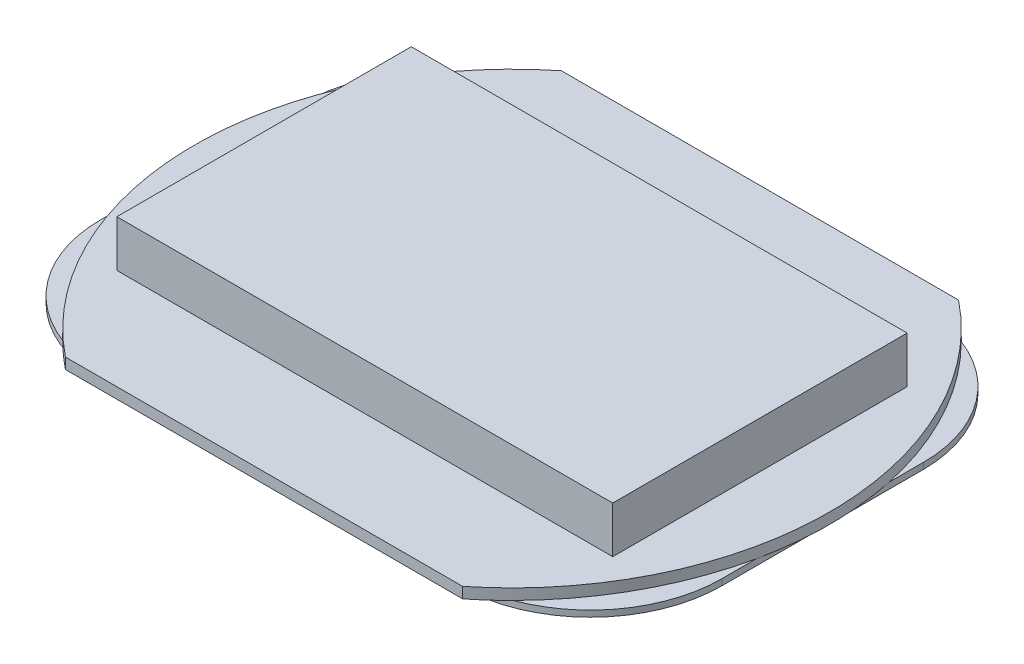
ISO-10303-21;
HEADER;
FILE_DESCRIPTION(('STEP AP214'),'2;1');
FILE_NAME('part.step','',(''),(''),'','','');
FILE_SCHEMA(('AUTOMOTIVE_DESIGN { 1 0 10303 214 1 1 1 1 }'));
ENDSEC;
DATA;
#1=APPLICATION_CONTEXT('core data for automotive mechanical design processes');
#2=APPLICATION_PROTOCOL_DEFINITION('international standard','automotive_design',2000,#1);
#3=PRODUCT_CONTEXT('',#1,'mechanical');
#4=PRODUCT('Part','Part','',(#3));
#5=PRODUCT_RELATED_PRODUCT_CATEGORY('part','',(#4));
#6=PRODUCT_DEFINITION_FORMATION('','',#4);
#7=PRODUCT_DEFINITION_CONTEXT('part definition',#1,'design');
#8=PRODUCT_DEFINITION('design','',#6,#7);
#9=PRODUCT_DEFINITION_SHAPE('','',#8);
#10=(LENGTH_UNIT() NAMED_UNIT(*) SI_UNIT(.MILLI.,.METRE.));
#11=(NAMED_UNIT(*) PLANE_ANGLE_UNIT() SI_UNIT($,.RADIAN.));
#12=(NAMED_UNIT(*) SI_UNIT($,.STERADIAN.) SOLID_ANGLE_UNIT());
#13=UNCERTAINTY_MEASURE_WITH_UNIT(LENGTH_MEASURE(1.E-05),#10,'distance_accuracy_value','');
#14=(GEOMETRIC_REPRESENTATION_CONTEXT(3) GLOBAL_UNCERTAINTY_ASSIGNED_CONTEXT((#13)) GLOBAL_UNIT_ASSIGNED_CONTEXT((#10,
#11,#12)) REPRESENTATION_CONTEXT('',''));
#15=CARTESIAN_POINT('',(0.,0.,0.));
#16=DIRECTION('',(0.,0.,1.));
#17=DIRECTION('',(1.,0.,0.));
#18=AXIS2_PLACEMENT_3D('',#15,#16,#17);
#19=CARTESIAN_POINT('',(0.,0.7,0.));
#20=DIRECTION('',(0.,-1.,0.));
#21=DIRECTION('',(0.,0.,-1.));
#22=AXIS2_PLACEMENT_3D('',#19,#20,#21);
#23=PLANE('',#22);
#24=CARTESIAN_POINT('',(0.,0.7,0.));
#25=DIRECTION('',(0.,1.,0.));
#26=DIRECTION('',(0.,0.,-1.));
#27=AXIS2_PLACEMENT_3D('',#24,#25,#26);
#28=CIRCLE('',#27,20.5);
#29=CARTESIAN_POINT('',(-12.8160056179763,0.7,-16.));
#30=VERTEX_POINT('',#29);
#31=CARTESIAN_POINT('',(-12.8160056179763,0.7,16.));
#32=VERTEX_POINT('',#31);
#33=EDGE_CURVE('E329',#30,#32,#28,.T.);
#34=ORIENTED_EDGE('',*,*,#33,.T.);
#35=DIRECTION('',(1.,0.,0.));
#36=VECTOR('',#35,1.);
#37=CARTESIAN_POINT('',(-12.8160056179763,0.7,16.));
#38=LINE('',#37,#36);
#39=CARTESIAN_POINT('',(12.8160056179763,0.7,16.));
#40=VERTEX_POINT('',#39);
#41=EDGE_CURVE('E332',#32,#40,#38,.T.);
#42=ORIENTED_EDGE('',*,*,#41,.T.);
#43=CARTESIAN_POINT('',(0.,0.7,0.));
#44=DIRECTION('',(0.,1.,0.));
#45=DIRECTION('',(0.,0.,1.));
#46=AXIS2_PLACEMENT_3D('',#43,#44,#45);
#47=CIRCLE('',#46,20.5);
#48=CARTESIAN_POINT('',(12.8160056179763,0.7,-16.));
#49=VERTEX_POINT('',#48);
#50=EDGE_CURVE('E335',#40,#49,#47,.T.);
#51=ORIENTED_EDGE('',*,*,#50,.T.);
#52=DIRECTION('',(-1.,0.,0.));
#53=VECTOR('',#52,1.);
#54=CARTESIAN_POINT('',(-12.8160056179763,0.7,-16.));
#55=LINE('',#54,#53);
#56=EDGE_CURVE('E337',#49,#30,#55,.T.);
#57=ORIENTED_EDGE('',*,*,#56,.T.);
#58=EDGE_LOOP('',(#34,#42,#51,#57));
#59=FACE_BOUND('',#58,.T.);
#60=DIRECTION('',(0.,0.,1.));
#61=VECTOR('',#60,1.);
#62=CARTESIAN_POINT('',(-16.,0.7,-9.5));
#63=LINE('',#62,#61);
#64=CARTESIAN_POINT('',(-16.,0.7,-9.5));
#65=VERTEX_POINT('',#64);
#66=CARTESIAN_POINT('',(-16.,0.7,9.5));
#67=VERTEX_POINT('',#66);
#68=EDGE_CURVE('E223',#65,#67,#63,.T.);
#69=ORIENTED_EDGE('',*,*,#68,.F.);
#70=DIRECTION('',(-1.,0.,0.));
#71=VECTOR('',#70,1.);
#72=CARTESIAN_POINT('',(-16.,0.7,-9.5));
#73=LINE('',#72,#71);
#74=CARTESIAN_POINT('',(16.,0.7,-9.5));
#75=VERTEX_POINT('',#74);
#76=EDGE_CURVE('E220',#75,#65,#73,.T.);
#77=ORIENTED_EDGE('',*,*,#76,.F.);
#78=DIRECTION('',(0.,0.,-1.));
#79=VECTOR('',#78,1.);
#80=CARTESIAN_POINT('',(16.,0.7,-9.5));
#81=LINE('',#80,#79);
#82=CARTESIAN_POINT('',(16.,0.7,9.5));
#83=VERTEX_POINT('',#82);
#84=EDGE_CURVE('E62',#83,#75,#81,.T.);
#85=ORIENTED_EDGE('',*,*,#84,.F.);
#86=DIRECTION('',(1.,0.,0.));
#87=VECTOR('',#86,1.);
#88=CARTESIAN_POINT('',(-16.,0.7,9.5));
#89=LINE('',#88,#87);
#90=EDGE_CURVE('E57',#67,#83,#89,.T.);
#91=ORIENTED_EDGE('',*,*,#90,.F.);
#92=EDGE_LOOP('',(#69,#77,#85,#91));
#93=FACE_BOUND('',#92,.T.);
#94=ADVANCED_FACE('F39',(#59,#93),#23,.F.);
#95=CARTESIAN_POINT('',(0.,0.,0.));
#96=DIRECTION('',(0.,-1.,0.));
#97=DIRECTION('',(0.,0.,-1.));
#98=AXIS2_PLACEMENT_3D('',#95,#96,#97);
#99=PLANE('',#98);
#100=CARTESIAN_POINT('',(-11.55,0.,6.49999999999998));
#101=DIRECTION('',(0.,-1.,0.));
#102=DIRECTION('',(0.,0.,-1.));
#103=AXIS2_PLACEMENT_3D('',#100,#101,#102);
#104=CIRCLE('',#103,8.50000000000002);
#105=CARTESIAN_POINT('',(-11.55,0.,15.));
#106=VERTEX_POINT('',#105);
#107=CARTESIAN_POINT('',(-14.5312597172372,0.,14.46003081014));
#108=VERTEX_POINT('',#107);
#109=EDGE_CURVE('E279',#106,#108,#104,.T.);
#110=ORIENTED_EDGE('',*,*,#109,.F.);
#111=DIRECTION('',(-1.,0.,0.));
#112=VECTOR('',#111,1.);
#113=CARTESIAN_POINT('',(-11.55,0.,15.));
#114=LINE('',#113,#112);
#115=CARTESIAN_POINT('',(11.55,0.,15.));
#116=VERTEX_POINT('',#115);
#117=EDGE_CURVE('E264',#116,#106,#114,.T.);
#118=ORIENTED_EDGE('',*,*,#117,.F.);
#119=CARTESIAN_POINT('',(11.55,0.,6.5));
#120=DIRECTION('',(0.,-1.,0.));
#121=DIRECTION('',(0.,0.,1.));
#122=AXIS2_PLACEMENT_3D('',#119,#120,#121);
#123=CIRCLE('',#122,8.5);
#124=CARTESIAN_POINT('',(14.5312597172372,0.,14.46003081014));
#125=VERTEX_POINT('',#124);
#126=EDGE_CURVE('E11',#125,#116,#123,.T.);
#127=ORIENTED_EDGE('',*,*,#126,.F.);
#128=CARTESIAN_POINT('',(0.,0.,0.));
#129=DIRECTION('',(0.,1.,0.));
#130=DIRECTION('',(0.,0.,1.));
#131=AXIS2_PLACEMENT_3D('',#128,#129,#130);
#132=CIRCLE('',#131,20.5);
#133=CARTESIAN_POINT('',(12.8160056179763,0.,16.));
#134=VERTEX_POINT('',#133);
#135=EDGE_CURVE('E347',#134,#125,#132,.T.);
#136=ORIENTED_EDGE('',*,*,#135,.F.);
#137=DIRECTION('',(1.,0.,0.));
#138=VECTOR('',#137,1.);
#139=CARTESIAN_POINT('',(-12.8160056179763,0.,16.));
#140=LINE('',#139,#138);
#141=CARTESIAN_POINT('',(-12.8160056179763,0.,16.));
#142=VERTEX_POINT('',#141);
#143=EDGE_CURVE('E343',#142,#134,#140,.T.);
#144=ORIENTED_EDGE('',*,*,#143,.F.);
#145=CARTESIAN_POINT('',(0.,0.,0.));
#146=DIRECTION('',(0.,1.,0.));
#147=DIRECTION('',(0.,0.,-1.));
#148=AXIS2_PLACEMENT_3D('',#145,#146,#147);
#149=CIRCLE('',#148,20.5);
#150=EDGE_CURVE('E328',#108,#142,#149,.T.);
#151=ORIENTED_EDGE('',*,*,#150,.F.);
#152=EDGE_LOOP('',(#110,#118,#127,#136,#144,#151));
#153=FACE_BOUND('',#152,.T.);
#154=ADVANCED_FACE('F390',(#153),#99,.T.);
#155=DIRECTION('',(0.,0.,1.));
#156=VECTOR('',#155,1.);
#157=CARTESIAN_POINT('',(20.05,0.,6.5));
#158=LINE('',#157,#156);
#159=CARTESIAN_POINT('',(20.05,0.,-4.2717092597694));
#160=VERTEX_POINT('',#159);
#161=CARTESIAN_POINT('',(20.05,0.,4.27170925976939));
#162=VERTEX_POINT('',#161);
#163=EDGE_CURVE('E48',#160,#162,#158,.T.);
#164=ORIENTED_EDGE('',*,*,#163,.F.);
#165=EDGE_CURVE('E507',#162,#160,#132,.T.);
#166=ORIENTED_EDGE('',*,*,#165,.F.);
#167=EDGE_LOOP('',(#164,#166));
#168=FACE_BOUND('',#167,.T.);
#169=ADVANCED_FACE('F435',(#168),#99,.T.);
#170=CARTESIAN_POINT('',(11.55,0.,-6.50000000000001));
#171=DIRECTION('',(0.,-1.,0.));
#172=DIRECTION('',(0.,0.,-1.));
#173=AXIS2_PLACEMENT_3D('',#170,#171,#172);
#174=CIRCLE('',#173,8.49999999999999);
#175=CARTESIAN_POINT('',(11.55,0.,-15.));
#176=VERTEX_POINT('',#175);
#177=CARTESIAN_POINT('',(14.5312597172372,0.,-14.46003081014));
#178=VERTEX_POINT('',#177);
#179=EDGE_CURVE('E295',#176,#178,#174,.T.);
#180=ORIENTED_EDGE('',*,*,#179,.F.);
#181=DIRECTION('',(1.,0.,0.));
#182=VECTOR('',#181,1.);
#183=CARTESIAN_POINT('',(-11.55,0.,-15.));
#184=LINE('',#183,#182);
#185=CARTESIAN_POINT('',(-11.55,0.,-15.));
#186=VERTEX_POINT('',#185);
#187=EDGE_CURVE('E290',#186,#176,#184,.T.);
#188=ORIENTED_EDGE('',*,*,#187,.F.);
#189=CARTESIAN_POINT('',(-11.55,0.,-6.49999999999999));
#190=DIRECTION('',(0.,-1.,0.));
#191=DIRECTION('',(0.,0.,-1.));
#192=AXIS2_PLACEMENT_3D('',#189,#190,#191);
#193=CIRCLE('',#192,8.50000000000001);
#194=CARTESIAN_POINT('',(-14.5312597172372,0.,-14.46003081014));
#195=VERTEX_POINT('',#194);
#196=EDGE_CURVE('E291',#195,#186,#193,.T.);
#197=ORIENTED_EDGE('',*,*,#196,.F.);
#198=CARTESIAN_POINT('',(-12.8160056179763,0.,-16.));
#199=VERTEX_POINT('',#198);
#200=EDGE_CURVE('E340',#199,#195,#149,.T.);
#201=ORIENTED_EDGE('',*,*,#200,.F.);
#202=DIRECTION('',(-1.,0.,0.));
#203=VECTOR('',#202,1.);
#204=CARTESIAN_POINT('',(-12.8160056179763,0.,-16.));
#205=LINE('',#204,#203);
#206=CARTESIAN_POINT('',(12.8160056179763,0.,-16.));
#207=VERTEX_POINT('',#206);
#208=EDGE_CURVE('E333',#207,#199,#205,.T.);
#209=ORIENTED_EDGE('',*,*,#208,.F.);
#210=EDGE_CURVE('E346',#178,#207,#132,.T.);
#211=ORIENTED_EDGE('',*,*,#210,.F.);
#212=EDGE_LOOP('',(#180,#188,#197,#201,#209,#211));
#213=FACE_BOUND('',#212,.T.);
#214=ADVANCED_FACE('F401',(#213),#99,.T.);
#215=CARTESIAN_POINT('',(0.,0.7,0.));
#216=DIRECTION('',(0.,-1.,0.));
#217=DIRECTION('',(0.,0.,-1.));
#218=AXIS2_PLACEMENT_3D('',#215,#216,#217);
#219=CYLINDRICAL_SURFACE('',#218,20.5);
#220=ORIENTED_EDGE('',*,*,#200,.T.);
#221=CARTESIAN_POINT('',(-20.05,0.,-4.2717092597695));
#222=VERTEX_POINT('',#221);
#223=EDGE_CURVE('E344',#195,#222,#149,.T.);
#224=ORIENTED_EDGE('',*,*,#223,.T.);
#225=CARTESIAN_POINT('',(-20.05,0.,4.2717092597695));
#226=VERTEX_POINT('',#225);
#227=EDGE_CURVE('E382',#222,#226,#149,.T.);
#228=ORIENTED_EDGE('',*,*,#227,.T.);
#229=EDGE_CURVE('E383',#226,#108,#149,.T.);
#230=ORIENTED_EDGE('',*,*,#229,.T.);
#231=ORIENTED_EDGE('',*,*,#150,.T.);
#232=DIRECTION('',(0.,-1.,0.));
#233=VECTOR('',#232,1.);
#234=CARTESIAN_POINT('',(-12.8160056179763,0.7,16.));
#235=LINE('',#234,#233);
#236=EDGE_CURVE('E43',#32,#142,#235,.T.);
#237=ORIENTED_EDGE('',*,*,#236,.F.);
#238=ORIENTED_EDGE('',*,*,#33,.F.);
#239=DIRECTION('',(0.,-1.,0.));
#240=VECTOR('',#239,1.);
#241=CARTESIAN_POINT('',(-12.8160056179763,0.7,-16.));
#242=LINE('',#241,#240);
#243=EDGE_CURVE('E339',#30,#199,#242,.T.);
#244=ORIENTED_EDGE('',*,*,#243,.T.);
#245=EDGE_LOOP('',(#220,#224,#228,#230,#231,#237,#238,#244));
#246=FACE_BOUND('',#245,.T.);
#247=ADVANCED_FACE('F41',(#246),#219,.T.);
#248=CARTESIAN_POINT('',(-12.8160056179763,0.7,16.));
#249=DIRECTION('',(0.,0.,-1.));
#250=DIRECTION('',(-1.,0.,0.));
#251=AXIS2_PLACEMENT_3D('',#248,#249,#250);
#252=PLANE('',#251);
#253=ORIENTED_EDGE('',*,*,#143,.T.);
#254=DIRECTION('',(0.,-1.,0.));
#255=VECTOR('',#254,1.);
#256=CARTESIAN_POINT('',(12.8160056179763,0.7,16.));
#257=LINE('',#256,#255);
#258=EDGE_CURVE('E356',#40,#134,#257,.T.);
#259=ORIENTED_EDGE('',*,*,#258,.F.);
#260=ORIENTED_EDGE('',*,*,#41,.F.);
#261=ORIENTED_EDGE('',*,*,#236,.T.);
#262=EDGE_LOOP('',(#253,#259,#260,#261));
#263=FACE_BOUND('',#262,.T.);
#264=ADVANCED_FACE('F391',(#263),#252,.F.);
#265=CARTESIAN_POINT('',(0.,0.7,0.));
#266=DIRECTION('',(0.,-1.,0.));
#267=DIRECTION('',(0.,0.,-1.));
#268=AXIS2_PLACEMENT_3D('',#265,#266,#267);
#269=CYLINDRICAL_SURFACE('',#268,20.5);
#270=ORIENTED_EDGE('',*,*,#135,.T.);
#271=EDGE_CURVE('E350',#125,#162,#132,.T.);
#272=ORIENTED_EDGE('',*,*,#271,.T.);
#273=ORIENTED_EDGE('',*,*,#165,.T.);
#274=EDGE_CURVE('E505',#160,#178,#132,.T.);
#275=ORIENTED_EDGE('',*,*,#274,.T.);
#276=ORIENTED_EDGE('',*,*,#210,.T.);
#277=DIRECTION('',(0.,-1.,0.));
#278=VECTOR('',#277,1.);
#279=CARTESIAN_POINT('',(12.8160056179763,0.7,-16.));
#280=LINE('',#279,#278);
#281=EDGE_CURVE('E354',#49,#207,#280,.T.);
#282=ORIENTED_EDGE('',*,*,#281,.F.);
#283=ORIENTED_EDGE('',*,*,#50,.F.);
#284=ORIENTED_EDGE('',*,*,#258,.T.);
#285=EDGE_LOOP('',(#270,#272,#273,#275,#276,#282,#283,#284));
#286=FACE_BOUND('',#285,.T.);
#287=ADVANCED_FACE('F393',(#286),#269,.T.);
#288=CARTESIAN_POINT('',(-12.8160056179763,0.7,-16.));
#289=DIRECTION('',(0.,0.,1.));
#290=DIRECTION('',(1.,0.,0.));
#291=AXIS2_PLACEMENT_3D('',#288,#289,#290);
#292=PLANE('',#291);
#293=ORIENTED_EDGE('',*,*,#208,.T.);
#294=ORIENTED_EDGE('',*,*,#243,.F.);
#295=ORIENTED_EDGE('',*,*,#56,.F.);
#296=ORIENTED_EDGE('',*,*,#281,.T.);
#297=EDGE_LOOP('',(#293,#294,#295,#296));
#298=FACE_BOUND('',#297,.T.);
#299=ADVANCED_FACE('F441',(#298),#292,.F.);
#300=DIRECTION('',(0.,0.,-1.));
#301=VECTOR('',#300,1.);
#302=CARTESIAN_POINT('',(-20.05,0.,6.5));
#303=LINE('',#302,#301);
#304=EDGE_CURVE('E287',#226,#222,#303,.T.);
#305=ORIENTED_EDGE('',*,*,#304,.F.);
#306=ORIENTED_EDGE('',*,*,#227,.F.);
#307=EDGE_LOOP('',(#305,#306));
#308=FACE_BOUND('',#307,.T.);
#309=ADVANCED_FACE('F427',(#308),#99,.T.);
#310=CARTESIAN_POINT('',(-11.55,0.,6.49999999999998));
#311=DIRECTION('',(0.,-1.,0.));
#312=DIRECTION('',(0.,0.,-1.));
#313=AXIS2_PLACEMENT_3D('',#310,#311,#312);
#314=PLANE('',#313);
#315=ORIENTED_EDGE('',*,*,#223,.F.);
#316=CARTESIAN_POINT('',(-20.05,0.,-6.5));
#317=VERTEX_POINT('',#316);
#318=EDGE_CURVE('E286',#317,#195,#193,.T.);
#319=ORIENTED_EDGE('',*,*,#318,.F.);
#320=EDGE_CURVE('E282',#222,#317,#303,.T.);
#321=ORIENTED_EDGE('',*,*,#320,.F.);
#322=EDGE_LOOP('',(#315,#319,#321));
#323=FACE_BOUND('',#322,.T.);
#324=ADVANCED_FACE('F378',(#323),#314,.F.);
#325=ORIENTED_EDGE('',*,*,#229,.F.);
#326=CARTESIAN_POINT('',(-20.05,0.,6.5));
#327=VERTEX_POINT('',#326);
#328=EDGE_CURVE('E283',#327,#226,#303,.T.);
#329=ORIENTED_EDGE('',*,*,#328,.F.);
#330=EDGE_CURVE('E259',#108,#327,#104,.T.);
#331=ORIENTED_EDGE('',*,*,#330,.F.);
#332=EDGE_LOOP('',(#325,#329,#331));
#333=FACE_BOUND('',#332,.T.);
#334=ADVANCED_FACE('F417',(#333),#314,.F.);
#335=ORIENTED_EDGE('',*,*,#271,.F.);
#336=CARTESIAN_POINT('',(20.05,0.,6.5));
#337=VERTEX_POINT('',#336);
#338=EDGE_CURVE('E50',#337,#125,#123,.T.);
#339=ORIENTED_EDGE('',*,*,#338,.F.);
#340=EDGE_CURVE('E298',#162,#337,#158,.T.);
#341=ORIENTED_EDGE('',*,*,#340,.F.);
#342=EDGE_LOOP('',(#335,#339,#341));
#343=FACE_BOUND('',#342,.T.);
#344=ADVANCED_FACE('F419',(#343),#314,.F.);
#345=CARTESIAN_POINT('',(-11.55,-0.4,6.49999999999998));
#346=DIRECTION('',(0.,-1.,0.));
#347=DIRECTION('',(0.,0.,-1.));
#348=AXIS2_PLACEMENT_3D('',#345,#346,#347);
#349=PLANE('',#348);
#350=CARTESIAN_POINT('',(-11.55,-0.4,6.49999999999998));
#351=DIRECTION('',(0.,-1.,0.));
#352=DIRECTION('',(0.,0.,-1.));
#353=AXIS2_PLACEMENT_3D('',#350,#351,#352);
#354=CIRCLE('',#353,8.50000000000002);
#355=CARTESIAN_POINT('',(-11.55,-0.4,15.));
#356=VERTEX_POINT('',#355);
#357=CARTESIAN_POINT('',(-20.05,-0.4,6.5));
#358=VERTEX_POINT('',#357);
#359=EDGE_CURVE('E260',#356,#358,#354,.T.);
#360=ORIENTED_EDGE('',*,*,#359,.T.);
#361=DIRECTION('',(0.,0.,-1.));
#362=VECTOR('',#361,1.);
#363=CARTESIAN_POINT('',(-20.05,-0.4,6.5));
#364=LINE('',#363,#362);
#365=CARTESIAN_POINT('',(-20.05,-0.4,-6.5));
#366=VERTEX_POINT('',#365);
#367=EDGE_CURVE('E263',#358,#366,#364,.T.);
#368=ORIENTED_EDGE('',*,*,#367,.T.);
#369=CARTESIAN_POINT('',(-11.55,-0.4,-6.49999999999999));
#370=DIRECTION('',(0.,-1.,0.));
#371=DIRECTION('',(0.,0.,-1.));
#372=AXIS2_PLACEMENT_3D('',#369,#370,#371);
#373=CIRCLE('',#372,8.50000000000001);
#374=CARTESIAN_POINT('',(-11.55,-0.4,-15.));
#375=VERTEX_POINT('',#374);
#376=EDGE_CURVE('E266',#366,#375,#373,.T.);
#377=ORIENTED_EDGE('',*,*,#376,.T.);
#378=DIRECTION('',(1.,0.,0.));
#379=VECTOR('',#378,1.);
#380=CARTESIAN_POINT('',(-11.55,-0.4,-15.));
#381=LINE('',#380,#379);
#382=CARTESIAN_POINT('',(11.55,-0.4,-15.));
#383=VERTEX_POINT('',#382);
#384=EDGE_CURVE('E268',#375,#383,#381,.T.);
#385=ORIENTED_EDGE('',*,*,#384,.T.);
#386=CARTESIAN_POINT('',(11.55,-0.4,-6.50000000000001));
#387=DIRECTION('',(0.,-1.,0.));
#388=DIRECTION('',(0.,0.,-1.));
#389=AXIS2_PLACEMENT_3D('',#386,#387,#388);
#390=CIRCLE('',#389,8.49999999999999);
#391=CARTESIAN_POINT('',(20.05,-0.4,-6.5));
#392=VERTEX_POINT('',#391);
#393=EDGE_CURVE('E270',#383,#392,#390,.T.);
#394=ORIENTED_EDGE('',*,*,#393,.T.);
#395=DIRECTION('',(0.,0.,1.));
#396=VECTOR('',#395,1.);
#397=CARTESIAN_POINT('',(20.05,-0.4,6.5));
#398=LINE('',#397,#396);
#399=CARTESIAN_POINT('',(20.05,-0.4,6.5));
#400=VERTEX_POINT('',#399);
#401=EDGE_CURVE('E272',#392,#400,#398,.T.);
#402=ORIENTED_EDGE('',*,*,#401,.T.);
#403=CARTESIAN_POINT('',(11.55,-0.4,6.5));
#404=DIRECTION('',(0.,-1.,0.));
#405=DIRECTION('',(0.,0.,1.));
#406=AXIS2_PLACEMENT_3D('',#403,#404,#405);
#407=CIRCLE('',#406,8.5);
#408=CARTESIAN_POINT('',(11.55,-0.4,15.));
#409=VERTEX_POINT('',#408);
#410=EDGE_CURVE('E274',#400,#409,#407,.T.);
#411=ORIENTED_EDGE('',*,*,#410,.T.);
#412=DIRECTION('',(-1.,0.,0.));
#413=VECTOR('',#412,1.);
#414=CARTESIAN_POINT('',(-11.55,-0.4,15.));
#415=LINE('',#414,#413);
#416=EDGE_CURVE('E276',#409,#356,#415,.T.);
#417=ORIENTED_EDGE('',*,*,#416,.T.);
#418=EDGE_LOOP('',(#360,#368,#377,#385,#394,#402,#411,#417));
#419=FACE_BOUND('',#418,.T.);
#420=DIRECTION('',(1.,0.,0.));
#421=VECTOR('',#420,1.);
#422=CARTESIAN_POINT('',(-11.,-0.4,-5.5));
#423=LINE('',#422,#421);
#424=CARTESIAN_POINT('',(-11.,-0.4,-5.5));
#425=VERTEX_POINT('',#424);
#426=CARTESIAN_POINT('',(11.,-0.4,-5.5));
#427=VERTEX_POINT('',#426);
#428=EDGE_CURVE('E235',#425,#427,#423,.T.);
#429=ORIENTED_EDGE('',*,*,#428,.F.);
#430=DIRECTION('',(0.,0.,-1.));
#431=VECTOR('',#430,1.);
#432=CARTESIAN_POINT('',(-11.,-0.4,5.5));
#433=LINE('',#432,#431);
#434=CARTESIAN_POINT('',(-11.,-0.4,5.5));
#435=VERTEX_POINT('',#434);
#436=EDGE_CURVE('E233',#435,#425,#433,.T.);
#437=ORIENTED_EDGE('',*,*,#436,.F.);
#438=DIRECTION('',(-1.,0.,0.));
#439=VECTOR('',#438,1.);
#440=CARTESIAN_POINT('',(-11.,-0.4,5.5));
#441=LINE('',#440,#439);
#442=CARTESIAN_POINT('',(11.,-0.4,5.5));
#443=VERTEX_POINT('',#442);
#444=EDGE_CURVE('E241',#443,#435,#441,.T.);
#445=ORIENTED_EDGE('',*,*,#444,.F.);
#446=DIRECTION('',(0.,0.,1.));
#447=VECTOR('',#446,1.);
#448=CARTESIAN_POINT('',(11.,-0.4,5.5));
#449=LINE('',#448,#447);
#450=EDGE_CURVE('E238',#427,#443,#449,.T.);
#451=ORIENTED_EDGE('',*,*,#450,.F.);
#452=EDGE_LOOP('',(#429,#437,#445,#451));
#453=FACE_BOUND('',#452,.T.);
#454=ADVANCED_FACE('F408',(#419,#453),#349,.T.);
#455=ORIENTED_EDGE('',*,*,#274,.F.);
#456=CARTESIAN_POINT('',(20.05,0.,-6.5));
#457=VERTEX_POINT('',#456);
#458=EDGE_CURVE('E299',#457,#160,#158,.T.);
#459=ORIENTED_EDGE('',*,*,#458,.F.);
#460=EDGE_CURVE('E294',#178,#457,#174,.T.);
#461=ORIENTED_EDGE('',*,*,#460,.F.);
#462=EDGE_LOOP('',(#455,#459,#461));
#463=FACE_BOUND('',#462,.T.);
#464=ADVANCED_FACE('F426',(#463),#314,.F.);
#465=CARTESIAN_POINT('',(-11.55,-0.4,6.49999999999998));
#466=DIRECTION('',(0.,1.,0.));
#467=DIRECTION('',(0.,0.,1.));
#468=AXIS2_PLACEMENT_3D('',#465,#466,#467);
#469=CYLINDRICAL_SURFACE('',#468,8.50000000000002);
#470=ORIENTED_EDGE('',*,*,#109,.T.);
#471=ORIENTED_EDGE('',*,*,#330,.T.);
#472=DIRECTION('',(0.,1.,0.));
#473=VECTOR('',#472,1.);
#474=CARTESIAN_POINT('',(-20.05,-0.4,6.5));
#475=LINE('',#474,#473);
#476=EDGE_CURVE('E325',#358,#327,#475,.T.);
#477=ORIENTED_EDGE('',*,*,#476,.F.);
#478=ORIENTED_EDGE('',*,*,#359,.F.);
#479=DIRECTION('',(0.,1.,0.));
#480=VECTOR('',#479,1.);
#481=CARTESIAN_POINT('',(-11.55,-0.4,15.));
#482=LINE('',#481,#480);
#483=EDGE_CURVE('E278',#356,#106,#482,.T.);
#484=ORIENTED_EDGE('',*,*,#483,.T.);
#485=EDGE_LOOP('',(#470,#471,#477,#478,#484));
#486=FACE_BOUND('',#485,.T.);
#487=ADVANCED_FACE('F415',(#486),#469,.T.);
#488=CARTESIAN_POINT('',(-20.05,-0.4,6.5));
#489=DIRECTION('',(1.,0.,0.));
#490=DIRECTION('',(0.,0.,-1.));
#491=AXIS2_PLACEMENT_3D('',#488,#489,#490);
#492=PLANE('',#491);
#493=ORIENTED_EDGE('',*,*,#328,.T.);
#494=ORIENTED_EDGE('',*,*,#304,.T.);
#495=ORIENTED_EDGE('',*,*,#320,.T.);
#496=DIRECTION('',(0.,1.,0.));
#497=VECTOR('',#496,1.);
#498=CARTESIAN_POINT('',(-20.05,-0.4,-6.5));
#499=LINE('',#498,#497);
#500=EDGE_CURVE('E322',#366,#317,#499,.T.);
#501=ORIENTED_EDGE('',*,*,#500,.F.);
#502=ORIENTED_EDGE('',*,*,#367,.F.);
#503=ORIENTED_EDGE('',*,*,#476,.T.);
#504=EDGE_LOOP('',(#493,#494,#495,#501,#502,#503));
#505=FACE_BOUND('',#504,.T.);
#506=ADVANCED_FACE('F370',(#505),#492,.F.);
#507=CARTESIAN_POINT('',(-11.55,-0.4,-6.49999999999999));
#508=DIRECTION('',(0.,1.,0.));
#509=DIRECTION('',(0.,0.,1.));
#510=AXIS2_PLACEMENT_3D('',#507,#508,#509);
#511=CYLINDRICAL_SURFACE('',#510,8.50000000000001);
#512=ORIENTED_EDGE('',*,*,#318,.T.);
#513=ORIENTED_EDGE('',*,*,#196,.T.);
#514=DIRECTION('',(0.,1.,0.));
#515=VECTOR('',#514,1.);
#516=CARTESIAN_POINT('',(-11.55,-0.4,-15.));
#517=LINE('',#516,#515);
#518=EDGE_CURVE('E319',#375,#186,#517,.T.);
#519=ORIENTED_EDGE('',*,*,#518,.F.);
#520=ORIENTED_EDGE('',*,*,#376,.F.);
#521=ORIENTED_EDGE('',*,*,#500,.T.);
#522=EDGE_LOOP('',(#512,#513,#519,#520,#521));
#523=FACE_BOUND('',#522,.T.);
#524=ADVANCED_FACE('F376',(#523),#511,.T.);
#525=CARTESIAN_POINT('',(-11.55,-0.4,-15.));
#526=DIRECTION('',(0.,0.,1.));
#527=DIRECTION('',(1.,0.,0.));
#528=AXIS2_PLACEMENT_3D('',#525,#526,#527);
#529=PLANE('',#528);
#530=ORIENTED_EDGE('',*,*,#187,.T.);
#531=DIRECTION('',(0.,1.,0.));
#532=VECTOR('',#531,1.);
#533=CARTESIAN_POINT('',(11.55,-0.4,-15.));
#534=LINE('',#533,#532);
#535=EDGE_CURVE('E316',#383,#176,#534,.T.);
#536=ORIENTED_EDGE('',*,*,#535,.F.);
#537=ORIENTED_EDGE('',*,*,#384,.F.);
#538=ORIENTED_EDGE('',*,*,#518,.T.);
#539=EDGE_LOOP('',(#530,#536,#537,#538));
#540=FACE_BOUND('',#539,.T.);
#541=ADVANCED_FACE('F404',(#540),#529,.F.);
#542=CARTESIAN_POINT('',(11.55,-0.4,-6.50000000000001));
#543=DIRECTION('',(0.,1.,0.));
#544=DIRECTION('',(0.,0.,1.));
#545=AXIS2_PLACEMENT_3D('',#542,#543,#544);
#546=CYLINDRICAL_SURFACE('',#545,8.49999999999999);
#547=ORIENTED_EDGE('',*,*,#179,.T.);
#548=ORIENTED_EDGE('',*,*,#460,.T.);
#549=DIRECTION('',(0.,1.,0.));
#550=VECTOR('',#549,1.);
#551=CARTESIAN_POINT('',(20.05,-0.4,-6.5));
#552=LINE('',#551,#550);
#553=EDGE_CURVE('E313',#392,#457,#552,.T.);
#554=ORIENTED_EDGE('',*,*,#553,.F.);
#555=ORIENTED_EDGE('',*,*,#393,.F.);
#556=ORIENTED_EDGE('',*,*,#535,.T.);
#557=EDGE_LOOP('',(#547,#548,#554,#555,#556));
#558=FACE_BOUND('',#557,.T.);
#559=ADVANCED_FACE('F514',(#558),#546,.T.);
#560=CARTESIAN_POINT('',(20.05,-0.4,6.5));
#561=DIRECTION('',(-1.,0.,0.));
#562=DIRECTION('',(0.,0.,1.));
#563=AXIS2_PLACEMENT_3D('',#560,#561,#562);
#564=PLANE('',#563);
#565=ORIENTED_EDGE('',*,*,#458,.T.);
#566=ORIENTED_EDGE('',*,*,#163,.T.);
#567=ORIENTED_EDGE('',*,*,#340,.T.);
#568=DIRECTION('',(0.,1.,0.));
#569=VECTOR('',#568,1.);
#570=CARTESIAN_POINT('',(20.05,-0.4,6.5));
#571=LINE('',#570,#569);
#572=EDGE_CURVE('E310',#400,#337,#571,.T.);
#573=ORIENTED_EDGE('',*,*,#572,.F.);
#574=ORIENTED_EDGE('',*,*,#401,.F.);
#575=ORIENTED_EDGE('',*,*,#553,.T.);
#576=EDGE_LOOP('',(#565,#566,#567,#573,#574,#575));
#577=FACE_BOUND('',#576,.T.);
#578=ADVANCED_FACE('F510',(#577),#564,.F.);
#579=CARTESIAN_POINT('',(11.55,-0.4,6.5));
#580=DIRECTION('',(0.,1.,0.));
#581=DIRECTION('',(0.,0.,1.));
#582=AXIS2_PLACEMENT_3D('',#579,#580,#581);
#583=CYLINDRICAL_SURFACE('',#582,8.5);
#584=ORIENTED_EDGE('',*,*,#338,.T.);
#585=ORIENTED_EDGE('',*,*,#126,.T.);
#586=DIRECTION('',(0.,1.,0.));
#587=VECTOR('',#586,1.);
#588=CARTESIAN_POINT('',(11.55,-0.4,15.));
#589=LINE('',#588,#587);
#590=EDGE_CURVE('E307',#409,#116,#589,.T.);
#591=ORIENTED_EDGE('',*,*,#590,.F.);
#592=ORIENTED_EDGE('',*,*,#410,.F.);
#593=ORIENTED_EDGE('',*,*,#572,.T.);
#594=EDGE_LOOP('',(#584,#585,#591,#592,#593));
#595=FACE_BOUND('',#594,.T.);
#596=ADVANCED_FACE('F521',(#595),#583,.T.);
#597=CARTESIAN_POINT('',(-11.55,-0.4,15.));
#598=DIRECTION('',(0.,0.,-1.));
#599=DIRECTION('',(-1.,0.,0.));
#600=AXIS2_PLACEMENT_3D('',#597,#598,#599);
#601=PLANE('',#600);
#602=ORIENTED_EDGE('',*,*,#117,.T.);
#603=ORIENTED_EDGE('',*,*,#483,.F.);
#604=ORIENTED_EDGE('',*,*,#416,.F.);
#605=ORIENTED_EDGE('',*,*,#590,.T.);
#606=EDGE_LOOP('',(#602,#603,#604,#605));
#607=FACE_BOUND('',#606,.T.);
#608=ADVANCED_FACE('F492',(#607),#601,.F.);
#609=CARTESIAN_POINT('',(-11.,-0.4,5.5));
#610=DIRECTION('',(1.,0.,0.));
#611=DIRECTION('',(0.,0.,-1.));
#612=AXIS2_PLACEMENT_3D('',#609,#610,#611);
#613=PLANE('',#612);
#614=DIRECTION('',(0.,0.,-1.));
#615=VECTOR('',#614,1.);
#616=CARTESIAN_POINT('',(-11.,0.,5.5));
#617=LINE('',#616,#615);
#618=CARTESIAN_POINT('',(-11.,0.,5.5));
#619=VERTEX_POINT('',#618);
#620=CARTESIAN_POINT('',(-11.,0.,-5.5));
#621=VERTEX_POINT('',#620);
#622=EDGE_CURVE('E224',#619,#621,#617,.T.);
#623=ORIENTED_EDGE('',*,*,#622,.F.);
#624=DIRECTION('',(0.,1.,0.));
#625=VECTOR('',#624,1.);
#626=CARTESIAN_POINT('',(-11.,-0.4,5.5));
#627=LINE('',#626,#625);
#628=EDGE_CURVE('E242',#435,#619,#627,.T.);
#629=ORIENTED_EDGE('',*,*,#628,.F.);
#630=ORIENTED_EDGE('',*,*,#436,.T.);
#631=DIRECTION('',(0.,1.,0.));
#632=VECTOR('',#631,1.);
#633=CARTESIAN_POINT('',(-11.,-0.4,-5.5));
#634=LINE('',#633,#632);
#635=EDGE_CURVE('E256',#425,#621,#634,.T.);
#636=ORIENTED_EDGE('',*,*,#635,.T.);
#637=EDGE_LOOP('',(#623,#629,#630,#636));
#638=FACE_BOUND('',#637,.T.);
#639=ADVANCED_FACE('F476',(#638),#613,.T.);
#640=CARTESIAN_POINT('',(-11.,-0.4,-5.5));
#641=DIRECTION('',(0.,0.,1.));
#642=DIRECTION('',(1.,0.,0.));
#643=AXIS2_PLACEMENT_3D('',#640,#641,#642);
#644=PLANE('',#643);
#645=DIRECTION('',(1.,0.,0.));
#646=VECTOR('',#645,1.);
#647=CARTESIAN_POINT('',(-11.,0.,-5.5));
#648=LINE('',#647,#646);
#649=CARTESIAN_POINT('',(11.,0.,-5.5));
#650=VERTEX_POINT('',#649);
#651=EDGE_CURVE('E227',#621,#650,#648,.T.);
#652=ORIENTED_EDGE('',*,*,#651,.F.);
#653=ORIENTED_EDGE('',*,*,#635,.F.);
#654=ORIENTED_EDGE('',*,*,#428,.T.);
#655=DIRECTION('',(0.,1.,0.));
#656=VECTOR('',#655,1.);
#657=CARTESIAN_POINT('',(11.,-0.4,-5.5));
#658=LINE('',#657,#656);
#659=EDGE_CURVE('E254',#427,#650,#658,.T.);
#660=ORIENTED_EDGE('',*,*,#659,.T.);
#661=EDGE_LOOP('',(#652,#653,#654,#660));
#662=FACE_BOUND('',#661,.T.);
#663=ADVANCED_FACE('F480',(#662),#644,.T.);
#664=CARTESIAN_POINT('',(11.,-0.4,5.5));
#665=DIRECTION('',(-1.,0.,0.));
#666=DIRECTION('',(0.,0.,1.));
#667=AXIS2_PLACEMENT_3D('',#664,#665,#666);
#668=PLANE('',#667);
#669=DIRECTION('',(0.,0.,1.));
#670=VECTOR('',#669,1.);
#671=CARTESIAN_POINT('',(11.,0.,5.5));
#672=LINE('',#671,#670);
#673=CARTESIAN_POINT('',(11.,0.,5.5));
#674=VERTEX_POINT('',#673);
#675=EDGE_CURVE('E246',#650,#674,#672,.T.);
#676=ORIENTED_EDGE('',*,*,#675,.F.);
#677=ORIENTED_EDGE('',*,*,#659,.F.);
#678=ORIENTED_EDGE('',*,*,#450,.T.);
#679=DIRECTION('',(0.,1.,0.));
#680=VECTOR('',#679,1.);
#681=CARTESIAN_POINT('',(11.,-0.4,5.5));
#682=LINE('',#681,#680);
#683=EDGE_CURVE('E252',#443,#674,#682,.T.);
#684=ORIENTED_EDGE('',*,*,#683,.T.);
#685=EDGE_LOOP('',(#676,#677,#678,#684));
#686=FACE_BOUND('',#685,.T.);
#687=ADVANCED_FACE('F466',(#686),#668,.T.);
#688=CARTESIAN_POINT('',(-11.,-0.4,5.5));
#689=DIRECTION('',(0.,0.,-1.));
#690=DIRECTION('',(-1.,0.,0.));
#691=AXIS2_PLACEMENT_3D('',#688,#689,#690);
#692=PLANE('',#691);
#693=DIRECTION('',(-1.,0.,0.));
#694=VECTOR('',#693,1.);
#695=CARTESIAN_POINT('',(-11.,0.,5.5));
#696=LINE('',#695,#694);
#697=EDGE_CURVE('E236',#674,#619,#696,.T.);
#698=ORIENTED_EDGE('',*,*,#697,.F.);
#699=ORIENTED_EDGE('',*,*,#683,.F.);
#700=ORIENTED_EDGE('',*,*,#444,.T.);
#701=ORIENTED_EDGE('',*,*,#628,.T.);
#702=EDGE_LOOP('',(#698,#699,#700,#701));
#703=FACE_BOUND('',#702,.T.);
#704=ADVANCED_FACE('F459',(#703),#692,.T.);
#705=ORIENTED_EDGE('',*,*,#697,.T.);
#706=ORIENTED_EDGE('',*,*,#622,.T.);
#707=ORIENTED_EDGE('',*,*,#651,.T.);
#708=ORIENTED_EDGE('',*,*,#675,.T.);
#709=EDGE_LOOP('',(#705,#706,#707,#708));
#710=FACE_BOUND('',#709,.T.);
#711=ADVANCED_FACE('F443',(#710),#99,.T.);
#712=CARTESIAN_POINT('',(-16.,3.7,-9.5));
#713=DIRECTION('',(1.,0.,0.));
#714=DIRECTION('',(0.,0.,-1.));
#715=AXIS2_PLACEMENT_3D('',#712,#713,#714);
#716=PLANE('',#715);
#717=ORIENTED_EDGE('',*,*,#68,.T.);
#718=DIRECTION('',(0.,-1.,0.));
#719=VECTOR('',#718,1.);
#720=CARTESIAN_POINT('',(-16.,3.7,9.5));
#721=LINE('',#720,#719);
#722=CARTESIAN_POINT('',(-16.,3.7,9.5));
#723=VERTEX_POINT('',#722);
#724=EDGE_CURVE('E204',#723,#67,#721,.T.);
#725=ORIENTED_EDGE('',*,*,#724,.F.);
#726=DIRECTION('',(0.,0.,1.));
#727=VECTOR('',#726,1.);
#728=CARTESIAN_POINT('',(-16.,3.7,-9.5));
#729=LINE('',#728,#727);
#730=CARTESIAN_POINT('',(-16.,3.7,-9.5));
#731=VERTEX_POINT('',#730);
#732=EDGE_CURVE('E211',#731,#723,#729,.T.);
#733=ORIENTED_EDGE('',*,*,#732,.F.);
#734=DIRECTION('',(0.,-1.,0.));
#735=VECTOR('',#734,1.);
#736=CARTESIAN_POINT('',(-16.,3.7,-9.5));
#737=LINE('',#736,#735);
#738=EDGE_CURVE('E646',#731,#65,#737,.T.);
#739=ORIENTED_EDGE('',*,*,#738,.T.);
#740=EDGE_LOOP('',(#717,#725,#733,#739));
#741=FACE_BOUND('',#740,.T.);
#742=ADVANCED_FACE('F222',(#741),#716,.F.);
#743=CARTESIAN_POINT('',(-16.,3.7,9.5));
#744=DIRECTION('',(0.,0.,-1.));
#745=DIRECTION('',(-1.,0.,0.));
#746=AXIS2_PLACEMENT_3D('',#743,#744,#745);
#747=PLANE('',#746);
#748=ORIENTED_EDGE('',*,*,#90,.T.);
#749=DIRECTION('',(0.,-1.,0.));
#750=VECTOR('',#749,1.);
#751=CARTESIAN_POINT('',(16.,3.7,9.5));
#752=LINE('',#751,#750);
#753=CARTESIAN_POINT('',(16.,3.7,9.5));
#754=VERTEX_POINT('',#753);
#755=EDGE_CURVE('E207',#754,#83,#752,.T.);
#756=ORIENTED_EDGE('',*,*,#755,.F.);
#757=DIRECTION('',(1.,0.,0.));
#758=VECTOR('',#757,1.);
#759=CARTESIAN_POINT('',(-16.,3.7,9.5));
#760=LINE('',#759,#758);
#761=EDGE_CURVE('E200',#723,#754,#760,.T.);
#762=ORIENTED_EDGE('',*,*,#761,.F.);
#763=ORIENTED_EDGE('',*,*,#724,.T.);
#764=EDGE_LOOP('',(#748,#756,#762,#763));
#765=FACE_BOUND('',#764,.T.);
#766=ADVANCED_FACE('F202',(#765),#747,.F.);
#767=CARTESIAN_POINT('',(16.,3.7,-9.5));
#768=DIRECTION('',(-1.,0.,0.));
#769=DIRECTION('',(0.,0.,1.));
#770=AXIS2_PLACEMENT_3D('',#767,#768,#769);
#771=PLANE('',#770);
#772=ORIENTED_EDGE('',*,*,#84,.T.);
#773=DIRECTION('',(0.,-1.,0.));
#774=VECTOR('',#773,1.);
#775=CARTESIAN_POINT('',(16.,3.7,-9.5));
#776=LINE('',#775,#774);
#777=CARTESIAN_POINT('',(16.,3.7,-9.5));
#778=VERTEX_POINT('',#777);
#779=EDGE_CURVE('E229',#778,#75,#776,.T.);
#780=ORIENTED_EDGE('',*,*,#779,.F.);
#781=DIRECTION('',(0.,0.,-1.));
#782=VECTOR('',#781,1.);
#783=CARTESIAN_POINT('',(16.,3.7,-9.5));
#784=LINE('',#783,#782);
#785=EDGE_CURVE('E210',#754,#778,#784,.T.);
#786=ORIENTED_EDGE('',*,*,#785,.F.);
#787=ORIENTED_EDGE('',*,*,#755,.T.);
#788=EDGE_LOOP('',(#772,#780,#786,#787));
#789=FACE_BOUND('',#788,.T.);
#790=ADVANCED_FACE('F613',(#789),#771,.F.);
#791=CARTESIAN_POINT('',(-16.,3.7,-9.5));
#792=DIRECTION('',(0.,0.,1.));
#793=DIRECTION('',(1.,0.,0.));
#794=AXIS2_PLACEMENT_3D('',#791,#792,#793);
#795=PLANE('',#794);
#796=ORIENTED_EDGE('',*,*,#76,.T.);
#797=ORIENTED_EDGE('',*,*,#738,.F.);
#798=DIRECTION('',(-1.,0.,0.));
#799=VECTOR('',#798,1.);
#800=CARTESIAN_POINT('',(-16.,3.7,-9.5));
#801=LINE('',#800,#799);
#802=EDGE_CURVE('E216',#778,#731,#801,.T.);
#803=ORIENTED_EDGE('',*,*,#802,.F.);
#804=ORIENTED_EDGE('',*,*,#779,.T.);
#805=EDGE_LOOP('',(#796,#797,#803,#804));
#806=FACE_BOUND('',#805,.T.);
#807=ADVANCED_FACE('F622',(#806),#795,.F.);
#808=CARTESIAN_POINT('',(0.,3.7,0.));
#809=DIRECTION('',(0.,1.,0.));
#810=DIRECTION('',(0.,0.,1.));
#811=AXIS2_PLACEMENT_3D('',#808,#809,#810);
#812=PLANE('',#811);
#813=ORIENTED_EDGE('',*,*,#732,.T.);
#814=ORIENTED_EDGE('',*,*,#761,.T.);
#815=ORIENTED_EDGE('',*,*,#785,.T.);
#816=ORIENTED_EDGE('',*,*,#802,.T.);
#817=EDGE_LOOP('',(#813,#814,#815,#816));
#818=FACE_BOUND('',#817,.T.);
#819=ADVANCED_FACE('F214',(#818),#812,.T.);
#820=CLOSED_SHELL('',(#94,#154,#169,#214,#247,#264,#287,#299,#309,#324,#334,#344,#454,#464,#487,
#506,#524,#541,#559,#578,#596,#608,#639,#663,#687,#704,#711,#742,#766,#790,#807,#819));
#821=MANIFOLD_SOLID_BREP('B2',#820);
#822=ADVANCED_BREP_SHAPE_REPRESENTATION('',(#18,#821),#14);
#823=SHAPE_DEFINITION_REPRESENTATION(#9,#822);
ENDSEC;
END-ISO-10303-21;
